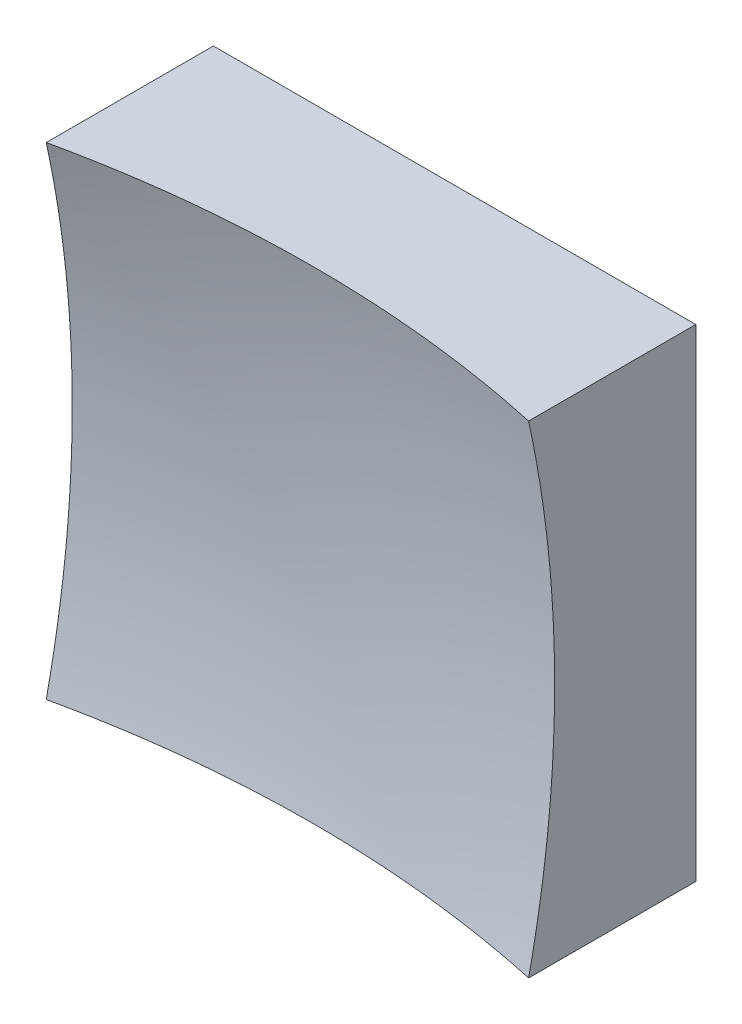
ISO-10303-21;
HEADER;
FILE_DESCRIPTION(('STEP AP214'),'2;1');
FILE_NAME('part.step','',(''),(''),'','','');
FILE_SCHEMA(('AUTOMOTIVE_DESIGN { 1 0 10303 214 1 1 1 1 }'));
ENDSEC;
DATA;
#1=APPLICATION_CONTEXT('core data for automotive mechanical design processes');
#2=APPLICATION_PROTOCOL_DEFINITION('international standard','automotive_design',2000,#1);
#3=PRODUCT_CONTEXT('',#1,'mechanical');
#4=PRODUCT('Part','Part','',(#3));
#5=PRODUCT_RELATED_PRODUCT_CATEGORY('part','',(#4));
#6=PRODUCT_DEFINITION_FORMATION('','',#4);
#7=PRODUCT_DEFINITION_CONTEXT('part definition',#1,'design');
#8=PRODUCT_DEFINITION('design','',#6,#7);
#9=PRODUCT_DEFINITION_SHAPE('','',#8);
#10=(LENGTH_UNIT() NAMED_UNIT(*) SI_UNIT(.MILLI.,.METRE.));
#11=(NAMED_UNIT(*) PLANE_ANGLE_UNIT() SI_UNIT($,.RADIAN.));
#12=(NAMED_UNIT(*) SI_UNIT($,.STERADIAN.) SOLID_ANGLE_UNIT());
#13=UNCERTAINTY_MEASURE_WITH_UNIT(LENGTH_MEASURE(1.E-05),#10,'distance_accuracy_value','');
#14=(GEOMETRIC_REPRESENTATION_CONTEXT(3) GLOBAL_UNCERTAINTY_ASSIGNED_CONTEXT((#13)) GLOBAL_UNIT_ASSIGNED_CONTEXT((#10,
#11,#12)) REPRESENTATION_CONTEXT('',''));
#15=CARTESIAN_POINT('',(0.,0.,0.));
#16=DIRECTION('',(0.,0.,1.));
#17=DIRECTION('',(1.,0.,0.));
#18=AXIS2_PLACEMENT_3D('',#15,#16,#17);
#19=CARTESIAN_POINT('',(-12.5,12.5,20.));
#20=DIRECTION('',(0.,1.,0.));
#21=DIRECTION('',(0.,0.,1.));
#22=AXIS2_PLACEMENT_3D('',#19,#20,#21);
#23=PLANE('',#22);
#24=CARTESIAN_POINT('',(0.,12.5,66.));
#25=DIRECTION('',(0.,1.,0.));
#26=DIRECTION('',(0.,0.,1.));
#27=AXIS2_PLACEMENT_3D('',#24,#25,#26);
#28=CIRCLE('',#27,58.6834729715275);
#29=CARTESIAN_POINT('',(12.5,12.5,8.66327529410143));
#30=VERTEX_POINT('',#29);
#31=CARTESIAN_POINT('',(-12.5,12.5,8.66327529410143));
#32=VERTEX_POINT('',#31);
#33=EDGE_CURVE('E79',#30,#32,#28,.T.);
#34=ORIENTED_EDGE('',*,*,#33,.F.);
#35=DIRECTION('',(0.,0.,-1.));
#36=VECTOR('',#35,1.);
#37=CARTESIAN_POINT('',(12.5,12.5,20.));
#38=LINE('',#37,#36);
#39=CARTESIAN_POINT('',(12.5,12.5,0.));
#40=VERTEX_POINT('',#39);
#41=EDGE_CURVE('E85',#30,#40,#38,.T.);
#42=ORIENTED_EDGE('',*,*,#41,.T.);
#43=DIRECTION('',(1.,0.,0.));
#44=VECTOR('',#43,1.);
#45=CARTESIAN_POINT('',(-12.5,12.5,0.));
#46=LINE('',#45,#44);
#47=CARTESIAN_POINT('',(-12.5,12.5,0.));
#48=VERTEX_POINT('',#47);
#49=EDGE_CURVE('E88',#48,#40,#46,.T.);
#50=ORIENTED_EDGE('',*,*,#49,.F.);
#51=DIRECTION('',(0.,0.,-1.));
#52=VECTOR('',#51,1.);
#53=CARTESIAN_POINT('',(-12.5,12.5,20.));
#54=LINE('',#53,#52);
#55=EDGE_CURVE('E47',#32,#48,#54,.T.);
#56=ORIENTED_EDGE('',*,*,#55,.F.);
#57=EDGE_LOOP('',(#34,#42,#50,#56));
#58=FACE_BOUND('',#57,.T.);
#59=ADVANCED_FACE('F39',(#58),#23,.T.);
#60=CARTESIAN_POINT('',(-12.5,12.5,20.));
#61=DIRECTION('',(1.,0.,0.));
#62=DIRECTION('',(0.,1.,0.));
#63=AXIS2_PLACEMENT_3D('',#60,#61,#62);
#64=PLANE('',#63);
#65=DIRECTION('',(0.,0.,-1.));
#66=VECTOR('',#65,1.);
#67=CARTESIAN_POINT('',(-12.5,-12.5,20.));
#68=LINE('',#67,#66);
#69=CARTESIAN_POINT('',(-12.5,-12.5,8.66327529410143));
#70=VERTEX_POINT('',#69);
#71=CARTESIAN_POINT('',(-12.5,-12.5,0.));
#72=VERTEX_POINT('',#71);
#73=EDGE_CURVE('E100',#70,#72,#68,.T.);
#74=ORIENTED_EDGE('',*,*,#73,.F.);
#75=CARTESIAN_POINT('',(-12.5,0.,66.));
#76=DIRECTION('',(1.,0.,0.));
#77=DIRECTION('',(0.,1.,0.));
#78=AXIS2_PLACEMENT_3D('',#75,#76,#77);
#79=CIRCLE('',#78,58.6834729715275);
#80=EDGE_CURVE('E89',#70,#32,#79,.T.);
#81=ORIENTED_EDGE('',*,*,#80,.T.);
#82=ORIENTED_EDGE('',*,*,#55,.T.);
#83=DIRECTION('',(0.,-1.,0.));
#84=VECTOR('',#83,1.);
#85=CARTESIAN_POINT('',(-12.5,12.5,0.));
#86=LINE('',#85,#84);
#87=EDGE_CURVE('E97',#48,#72,#86,.T.);
#88=ORIENTED_EDGE('',*,*,#87,.T.);
#89=EDGE_LOOP('',(#74,#81,#82,#88));
#90=FACE_BOUND('',#89,.T.);
#91=ADVANCED_FACE('F122',(#90),#64,.F.);
#92=CARTESIAN_POINT('',(-12.5,-12.5,20.));
#93=DIRECTION('',(0.,1.,0.));
#94=DIRECTION('',(0.,0.,1.));
#95=AXIS2_PLACEMENT_3D('',#92,#93,#94);
#96=PLANE('',#95);
#97=DIRECTION('',(0.,0.,-1.));
#98=VECTOR('',#97,1.);
#99=CARTESIAN_POINT('',(12.5,-12.5,20.));
#100=LINE('',#99,#98);
#101=CARTESIAN_POINT('',(12.5,-12.5,8.66327529410143));
#102=VERTEX_POINT('',#101);
#103=CARTESIAN_POINT('',(12.5,-12.5,0.));
#104=VERTEX_POINT('',#103);
#105=EDGE_CURVE('E96',#102,#104,#100,.T.);
#106=ORIENTED_EDGE('',*,*,#105,.F.);
#107=CARTESIAN_POINT('',(0.,-12.5,66.));
#108=DIRECTION('',(0.,1.,0.));
#109=DIRECTION('',(0.,0.,1.));
#110=AXIS2_PLACEMENT_3D('',#107,#108,#109);
#111=CIRCLE('',#110,58.6834729715275);
#112=EDGE_CURVE('E53',#102,#70,#111,.T.);
#113=ORIENTED_EDGE('',*,*,#112,.T.);
#114=ORIENTED_EDGE('',*,*,#73,.T.);
#115=DIRECTION('',(1.,0.,0.));
#116=VECTOR('',#115,1.);
#117=CARTESIAN_POINT('',(-12.5,-12.5,0.));
#118=LINE('',#117,#116);
#119=EDGE_CURVE('E102',#72,#104,#118,.T.);
#120=ORIENTED_EDGE('',*,*,#119,.T.);
#121=EDGE_LOOP('',(#106,#113,#114,#120));
#122=FACE_BOUND('',#121,.T.);
#123=ADVANCED_FACE('F121',(#122),#96,.F.);
#124=CARTESIAN_POINT('',(12.5,12.5,20.));
#125=DIRECTION('',(1.,0.,0.));
#126=DIRECTION('',(0.,1.,0.));
#127=AXIS2_PLACEMENT_3D('',#124,#125,#126);
#128=PLANE('',#127);
#129=CARTESIAN_POINT('',(12.5,0.,66.));
#130=DIRECTION('',(1.,0.,0.));
#131=DIRECTION('',(0.,1.,0.));
#132=AXIS2_PLACEMENT_3D('',#129,#130,#131);
#133=CIRCLE('',#132,58.6834729715275);
#134=EDGE_CURVE('E11',#102,#30,#133,.T.);
#135=ORIENTED_EDGE('',*,*,#134,.F.);
#136=ORIENTED_EDGE('',*,*,#105,.T.);
#137=DIRECTION('',(0.,-1.,0.));
#138=VECTOR('',#137,1.);
#139=CARTESIAN_POINT('',(12.5,12.5,0.));
#140=LINE('',#139,#138);
#141=EDGE_CURVE('E93',#40,#104,#140,.T.);
#142=ORIENTED_EDGE('',*,*,#141,.F.);
#143=ORIENTED_EDGE('',*,*,#41,.F.);
#144=EDGE_LOOP('',(#135,#136,#142,#143));
#145=FACE_BOUND('',#144,.T.);
#146=ADVANCED_FACE('F91',(#145),#128,.T.);
#147=CARTESIAN_POINT('',(0.,0.,0.));
#148=DIRECTION('',(0.,0.,-1.));
#149=DIRECTION('',(-1.,0.,0.));
#150=AXIS2_PLACEMENT_3D('',#147,#148,#149);
#151=PLANE('',#150);
#152=ORIENTED_EDGE('',*,*,#49,.T.);
#153=ORIENTED_EDGE('',*,*,#141,.T.);
#154=ORIENTED_EDGE('',*,*,#119,.F.);
#155=ORIENTED_EDGE('',*,*,#87,.F.);
#156=EDGE_LOOP('',(#152,#153,#154,#155));
#157=FACE_BOUND('',#156,.T.);
#158=ADVANCED_FACE('F125',(#157),#151,.T.);
#159=CARTESIAN_POINT('',(0.,0.,66.));
#160=DIRECTION('',(0.,0.,1.));
#161=DIRECTION('',(1.,0.,0.));
#162=AXIS2_PLACEMENT_3D('',#159,#160,#161);
#163=SPHERICAL_SURFACE('',#162,60.);
#164=ORIENTED_EDGE('',*,*,#33,.T.);
#165=ORIENTED_EDGE('',*,*,#80,.F.);
#166=ORIENTED_EDGE('',*,*,#112,.F.);
#167=ORIENTED_EDGE('',*,*,#134,.T.);
#168=EDGE_LOOP('',(#164,#165,#166,#167));
#169=FACE_BOUND('',#168,.T.);
#170=ADVANCED_FACE('F78',(#169),#163,.F.);
#171=CLOSED_SHELL('',(#59,#91,#123,#146,#158,#170));
#172=MANIFOLD_SOLID_BREP('B2',#171);
#173=ADVANCED_BREP_SHAPE_REPRESENTATION('',(#18,#172),#14);
#174=SHAPE_DEFINITION_REPRESENTATION(#9,#173);
ENDSEC;
END-ISO-10303-21;
